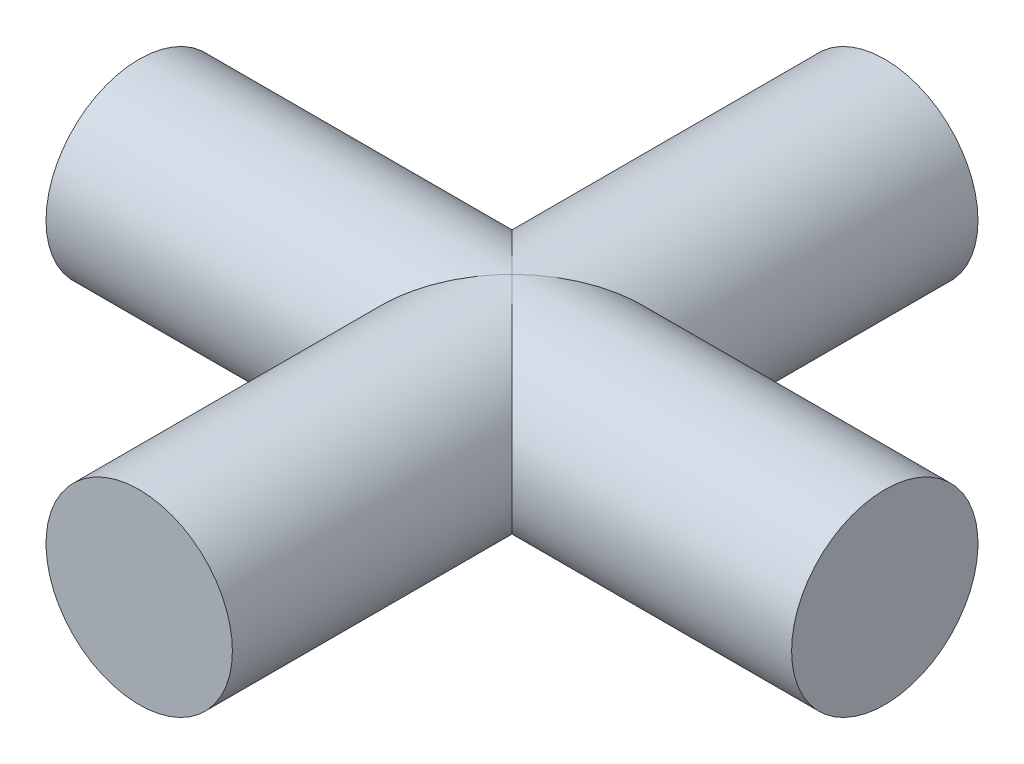
ISO-10303-21;
HEADER;
FILE_DESCRIPTION(('STEP AP214'),'2;1');
FILE_NAME('part.step','',(''),(''),'','','');
FILE_SCHEMA(('AUTOMOTIVE_DESIGN { 1 0 10303 214 1 1 1 1 }'));
ENDSEC;
DATA;
#1=APPLICATION_CONTEXT('core data for automotive mechanical design processes');
#2=APPLICATION_PROTOCOL_DEFINITION('international standard','automotive_design',2000,#1);
#3=PRODUCT_CONTEXT('',#1,'mechanical');
#4=PRODUCT('Part','Part','',(#3));
#5=PRODUCT_RELATED_PRODUCT_CATEGORY('part','',(#4));
#6=PRODUCT_DEFINITION_FORMATION('','',#4);
#7=PRODUCT_DEFINITION_CONTEXT('part definition',#1,'design');
#8=PRODUCT_DEFINITION('design','',#6,#7);
#9=PRODUCT_DEFINITION_SHAPE('','',#8);
#10=(LENGTH_UNIT() NAMED_UNIT(*) SI_UNIT(.MILLI.,.METRE.));
#11=(NAMED_UNIT(*) PLANE_ANGLE_UNIT() SI_UNIT($,.RADIAN.));
#12=(NAMED_UNIT(*) SI_UNIT($,.STERADIAN.) SOLID_ANGLE_UNIT());
#13=UNCERTAINTY_MEASURE_WITH_UNIT(LENGTH_MEASURE(1.E-05),#10,'distance_accuracy_value','');
#14=(GEOMETRIC_REPRESENTATION_CONTEXT(3) GLOBAL_UNCERTAINTY_ASSIGNED_CONTEXT((#13)) GLOBAL_UNIT_ASSIGNED_CONTEXT((#10,
#11,#12)) REPRESENTATION_CONTEXT('',''));
#15=CARTESIAN_POINT('',(0.,0.,0.));
#16=DIRECTION('',(0.,0.,1.));
#17=DIRECTION('',(1.,0.,0.));
#18=AXIS2_PLACEMENT_3D('',#15,#16,#17);
#19=CARTESIAN_POINT('',(0.,0.,50.8));
#20=DIRECTION('',(0.,0.,-1.));
#21=DIRECTION('',(-1.,0.,0.));
#22=AXIS2_PLACEMENT_3D('',#19,#20,#21);
#23=CYLINDRICAL_SURFACE('',#22,6.35);
#24=CARTESIAN_POINT('',(0.,0.,50.8));
#25=DIRECTION('',(0.,0.,1.));
#26=DIRECTION('',(1.,0.,0.));
#27=AXIS2_PLACEMENT_3D('',#24,#25,#26);
#28=CIRCLE('',#27,6.35);
#29=CARTESIAN_POINT('',(6.35,0.,50.8));
#30=VERTEX_POINT('',#29);
#31=EDGE_CURVE('E66',#30,#30,#28,.T.);
#32=ORIENTED_EDGE('',*,*,#31,.F.);
#33=EDGE_LOOP('',(#32));
#34=FACE_BOUND('',#33,.T.);
#35=CARTESIAN_POINT('',(0.,0.,25.4));
#36=DIRECTION('',(0.707106781186549,0.,-0.707106781186546));
#37=DIRECTION('',(-0.707106781186546,0.,-0.707106781186549));
#38=AXIS2_PLACEMENT_3D('',#35,#36,#37);
#39=ELLIPSE('',#38,8.98025612106917,6.35);
#40=CARTESIAN_POINT('',(0.,6.35,25.4));
#41=VERTEX_POINT('',#40);
#42=CARTESIAN_POINT('',(0.,-6.35,25.4));
#43=VERTEX_POINT('',#42);
#44=EDGE_CURVE('E48',#41,#43,#39,.T.);
#45=ORIENTED_EDGE('',*,*,#44,.F.);
#46=CARTESIAN_POINT('',(0.,0.,25.4));
#47=DIRECTION('',(-0.707106781186546,0.,-0.707106781186549));
#48=DIRECTION('',(0.707106781186549,0.,-0.707106781186546));
#49=AXIS2_PLACEMENT_3D('',#46,#47,#48);
#50=ELLIPSE('',#49,8.98025612106913,6.35);
#51=EDGE_CURVE('E60',#43,#41,#50,.T.);
#52=ORIENTED_EDGE('',*,*,#51,.F.);
#53=EDGE_LOOP('',(#45,#52));
#54=FACE_BOUND('',#53,.T.);
#55=ADVANCED_FACE('F39',(#34,#54),#23,.T.);
#56=CARTESIAN_POINT('',(0.,0.,50.8));
#57=DIRECTION('',(0.,0.,1.));
#58=DIRECTION('',(1.,0.,0.));
#59=AXIS2_PLACEMENT_3D('',#56,#57,#58);
#60=PLANE('',#59);
#61=ORIENTED_EDGE('',*,*,#31,.T.);
#62=EDGE_LOOP('',(#61));
#63=FACE_BOUND('',#62,.T.);
#64=ADVANCED_FACE('F90',(#63),#60,.T.);
#65=CARTESIAN_POINT('',(25.4,0.,25.4000000000001));
#66=DIRECTION('',(-1.,0.,0.));
#67=DIRECTION('',(0.,0.,1.));
#68=AXIS2_PLACEMENT_3D('',#65,#66,#67);
#69=PLANE('',#68);
#70=CARTESIAN_POINT('',(25.4,0.,25.4000000000001));
#71=DIRECTION('',(-1.,0.,0.));
#72=DIRECTION('',(0.,0.,1.));
#73=AXIS2_PLACEMENT_3D('',#70,#71,#72);
#74=CIRCLE('',#73,6.35);
#75=CARTESIAN_POINT('',(25.4,0.,31.7500000000001));
#76=VERTEX_POINT('',#75);
#77=EDGE_CURVE('E106',#76,#76,#74,.T.);
#78=ORIENTED_EDGE('',*,*,#77,.F.);
#79=EDGE_LOOP('',(#78));
#80=FACE_BOUND('',#79,.T.);
#81=ADVANCED_FACE('F87',(#80),#69,.F.);
#82=CARTESIAN_POINT('',(-25.4,0.,25.3999999999999));
#83=DIRECTION('',(1.,0.,0.));
#84=DIRECTION('',(0.,0.,-1.));
#85=AXIS2_PLACEMENT_3D('',#82,#83,#84);
#86=CYLINDRICAL_SURFACE('',#85,6.35);
#87=ORIENTED_EDGE('',*,*,#77,.T.);
#88=EDGE_LOOP('',(#87));
#89=FACE_BOUND('',#88,.T.);
#90=CARTESIAN_POINT('',(0.,0.,25.4));
#91=DIRECTION('',(-0.707106781186546,0.,-0.707106781186549));
#92=DIRECTION('',(0.707106781186549,0.,-0.707106781186546));
#93=AXIS2_PLACEMENT_3D('',#90,#91,#92);
#94=ELLIPSE('',#93,8.98025612106913,6.35);
#95=EDGE_CURVE('E54',#43,#41,#94,.F.);
#96=ORIENTED_EDGE('',*,*,#95,.T.);
#97=ORIENTED_EDGE('',*,*,#44,.T.);
#98=EDGE_LOOP('',(#96,#97));
#99=FACE_BOUND('',#98,.T.);
#100=ADVANCED_FACE('F68',(#89,#99),#86,.T.);
#101=CARTESIAN_POINT('',(0.,0.,0.));
#102=DIRECTION('',(0.,0.,1.));
#103=DIRECTION('',(1.,0.,0.));
#104=AXIS2_PLACEMENT_3D('',#101,#102,#103);
#105=PLANE('',#104);
#106=CARTESIAN_POINT('',(0.,0.,0.));
#107=DIRECTION('',(0.,0.,1.));
#108=DIRECTION('',(1.,0.,0.));
#109=AXIS2_PLACEMENT_3D('',#106,#107,#108);
#110=CIRCLE('',#109,6.35);
#111=CARTESIAN_POINT('',(6.35,0.,0.));
#112=VERTEX_POINT('',#111);
#113=EDGE_CURVE('E99',#112,#112,#110,.T.);
#114=ORIENTED_EDGE('',*,*,#113,.F.);
#115=EDGE_LOOP('',(#114));
#116=FACE_BOUND('',#115,.T.);
#117=ADVANCED_FACE('F81',(#116),#105,.F.);
#118=ORIENTED_EDGE('',*,*,#113,.T.);
#119=EDGE_LOOP('',(#118));
#120=FACE_BOUND('',#119,.T.);
#121=CARTESIAN_POINT('',(0.,0.,25.4));
#122=DIRECTION('',(0.707106781186549,0.,-0.707106781186546));
#123=DIRECTION('',(-0.707106781186546,0.,-0.707106781186549));
#124=AXIS2_PLACEMENT_3D('',#121,#122,#123);
#125=ELLIPSE('',#124,8.98025612106917,6.35);
#126=EDGE_CURVE('E11',#41,#43,#125,.F.);
#127=ORIENTED_EDGE('',*,*,#126,.F.);
#128=ORIENTED_EDGE('',*,*,#95,.F.);
#129=EDGE_LOOP('',(#127,#128));
#130=FACE_BOUND('',#129,.T.);
#131=ADVANCED_FACE('F41',(#120,#130),#23,.T.);
#132=CARTESIAN_POINT('',(-25.4,0.,25.3999999999999));
#133=DIRECTION('',(-1.,0.,0.));
#134=DIRECTION('',(0.,0.,1.));
#135=AXIS2_PLACEMENT_3D('',#132,#133,#134);
#136=CIRCLE('',#135,6.35);
#137=CARTESIAN_POINT('',(-25.4,0.,31.7499999999999));
#138=VERTEX_POINT('',#137);
#139=EDGE_CURVE('E103',#138,#138,#136,.T.);
#140=ORIENTED_EDGE('',*,*,#139,.F.);
#141=EDGE_LOOP('',(#140));
#142=FACE_BOUND('',#141,.T.);
#143=ORIENTED_EDGE('',*,*,#51,.T.);
#144=ORIENTED_EDGE('',*,*,#126,.T.);
#145=EDGE_LOOP('',(#143,#144));
#146=FACE_BOUND('',#145,.T.);
#147=ADVANCED_FACE('F70',(#142,#146),#86,.T.);
#148=CARTESIAN_POINT('',(-25.4,0.,25.3999999999999));
#149=DIRECTION('',(-1.,0.,0.));
#150=DIRECTION('',(0.,0.,1.));
#151=AXIS2_PLACEMENT_3D('',#148,#149,#150);
#152=PLANE('',#151);
#153=ORIENTED_EDGE('',*,*,#139,.T.);
#154=EDGE_LOOP('',(#153));
#155=FACE_BOUND('',#154,.T.);
#156=ADVANCED_FACE('F72',(#155),#152,.T.);
#157=CLOSED_SHELL('',(#55,#64,#81,#100,#117,#131,#147,#156));
#158=MANIFOLD_SOLID_BREP('B2',#157);
#159=ADVANCED_BREP_SHAPE_REPRESENTATION('',(#18,#158),#14);
#160=SHAPE_DEFINITION_REPRESENTATION(#9,#159);
ENDSEC;
END-ISO-10303-21;
